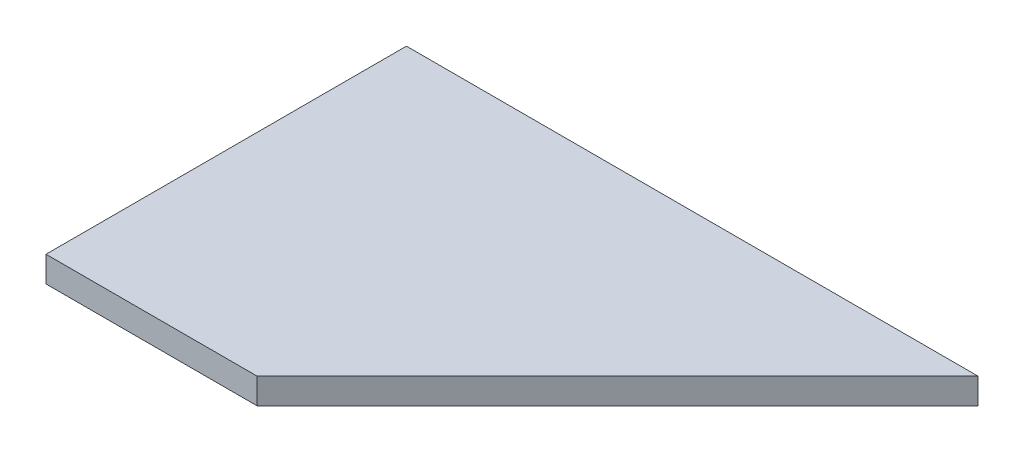
ISO-10303-21;
HEADER;
FILE_DESCRIPTION(('STEP AP214'),'2;1');
FILE_NAME('part.step','',(''),(''),'','','');
FILE_SCHEMA(('AUTOMOTIVE_DESIGN { 1 0 10303 214 1 1 1 1 }'));
ENDSEC;
DATA;
#1=APPLICATION_CONTEXT('core data for automotive mechanical design processes');
#2=APPLICATION_PROTOCOL_DEFINITION('international standard','automotive_design',2000,#1);
#3=PRODUCT_CONTEXT('',#1,'mechanical');
#4=PRODUCT('Part','Part','',(#3));
#5=PRODUCT_RELATED_PRODUCT_CATEGORY('part','',(#4));
#6=PRODUCT_DEFINITION_FORMATION('','',#4);
#7=PRODUCT_DEFINITION_CONTEXT('part definition',#1,'design');
#8=PRODUCT_DEFINITION('design','',#6,#7);
#9=PRODUCT_DEFINITION_SHAPE('','',#8);
#10=(LENGTH_UNIT() NAMED_UNIT(*) SI_UNIT(.MILLI.,.METRE.));
#11=(NAMED_UNIT(*) PLANE_ANGLE_UNIT() SI_UNIT($,.RADIAN.));
#12=(NAMED_UNIT(*) SI_UNIT($,.STERADIAN.) SOLID_ANGLE_UNIT());
#13=UNCERTAINTY_MEASURE_WITH_UNIT(LENGTH_MEASURE(1.E-05),#10,'distance_accuracy_value','');
#14=(GEOMETRIC_REPRESENTATION_CONTEXT(3) GLOBAL_UNCERTAINTY_ASSIGNED_CONTEXT((#13)) GLOBAL_UNIT_ASSIGNED_CONTEXT((#10,
#11,#12)) REPRESENTATION_CONTEXT('',''));
#15=CARTESIAN_POINT('',(0.,0.,0.));
#16=DIRECTION('',(0.,0.,1.));
#17=DIRECTION('',(1.,0.,0.));
#18=AXIS2_PLACEMENT_3D('',#15,#16,#17);
#19=CARTESIAN_POINT('',(-33.3,3.,-21.));
#20=DIRECTION('',(1.,0.,0.));
#21=DIRECTION('',(0.,0.,-1.));
#22=AXIS2_PLACEMENT_3D('',#19,#20,#21);
#23=PLANE('',#22);
#24=DIRECTION('',(0.,0.,1.));
#25=VECTOR('',#24,1.);
#26=CARTESIAN_POINT('',(-33.3,0.,-21.));
#27=LINE('',#26,#25);
#28=CARTESIAN_POINT('',(-33.3,0.,-21.));
#29=VERTEX_POINT('',#28);
#30=CARTESIAN_POINT('',(-33.3,0.,21.));
#31=VERTEX_POINT('',#30);
#32=EDGE_CURVE('E96',#29,#31,#27,.T.);
#33=ORIENTED_EDGE('',*,*,#32,.T.);
#34=DIRECTION('',(0.,-1.,0.));
#35=VECTOR('',#34,1.);
#36=CARTESIAN_POINT('',(-33.3,3.,21.));
#37=LINE('',#36,#35);
#38=CARTESIAN_POINT('',(-33.3,3.,21.));
#39=VERTEX_POINT('',#38);
#40=EDGE_CURVE('E11',#39,#31,#37,.T.);
#41=ORIENTED_EDGE('',*,*,#40,.F.);
#42=DIRECTION('',(0.,0.,1.));
#43=VECTOR('',#42,1.);
#44=CARTESIAN_POINT('',(-33.3,3.,-21.));
#45=LINE('',#44,#43);
#46=CARTESIAN_POINT('',(-33.3,3.,-21.));
#47=VERTEX_POINT('',#46);
#48=EDGE_CURVE('E84',#47,#39,#45,.T.);
#49=ORIENTED_EDGE('',*,*,#48,.F.);
#50=DIRECTION('',(0.,-1.,0.));
#51=VECTOR('',#50,1.);
#52=CARTESIAN_POINT('',(-33.3,3.,-21.));
#53=LINE('',#52,#51);
#54=EDGE_CURVE('E92',#47,#29,#53,.T.);
#55=ORIENTED_EDGE('',*,*,#54,.T.);
#56=EDGE_LOOP('',(#33,#41,#49,#55));
#57=FACE_BOUND('',#56,.T.);
#58=ADVANCED_FACE('F33',(#57),#23,.F.);
#59=CARTESIAN_POINT('',(-33.3,3.,21.));
#60=DIRECTION('',(0.,0.,-1.));
#61=DIRECTION('',(-1.,0.,0.));
#62=AXIS2_PLACEMENT_3D('',#59,#60,#61);
#63=PLANE('',#62);
#64=DIRECTION('',(1.,0.,0.));
#65=VECTOR('',#64,1.);
#66=CARTESIAN_POINT('',(-33.3,0.,21.));
#67=LINE('',#66,#65);
#68=CARTESIAN_POINT('',(-8.69999999999928,0.,21.));
#69=VERTEX_POINT('',#68);
#70=EDGE_CURVE('E88',#31,#69,#67,.T.);
#71=ORIENTED_EDGE('',*,*,#70,.T.);
#72=DIRECTION('',(0.,-1.,0.));
#73=VECTOR('',#72,1.);
#74=CARTESIAN_POINT('',(-8.69999999999928,3.,21.));
#75=LINE('',#74,#73);
#76=CARTESIAN_POINT('',(-8.69999999999928,3.,21.));
#77=VERTEX_POINT('',#76);
#78=EDGE_CURVE('E41',#77,#69,#75,.T.);
#79=ORIENTED_EDGE('',*,*,#78,.F.);
#80=DIRECTION('',(1.,0.,0.));
#81=VECTOR('',#80,1.);
#82=CARTESIAN_POINT('',(-33.3,3.,21.));
#83=LINE('',#82,#81);
#84=EDGE_CURVE('E79',#39,#77,#83,.T.);
#85=ORIENTED_EDGE('',*,*,#84,.F.);
#86=ORIENTED_EDGE('',*,*,#40,.T.);
#87=EDGE_LOOP('',(#71,#79,#85,#86));
#88=FACE_BOUND('',#87,.T.);
#89=ADVANCED_FACE('F87',(#88),#63,.F.);
#90=CARTESIAN_POINT('',(33.3,3.,-21.));
#91=DIRECTION('',(-0.707106781186554,0.,-0.707106781186541));
#92=DIRECTION('',(-0.707106781186541,0.,0.707106781186554));
#93=AXIS2_PLACEMENT_3D('',#90,#91,#92);
#94=PLANE('',#93);
#95=DIRECTION('',(0.707106781186541,0.,-0.707106781186554));
#96=VECTOR('',#95,1.);
#97=CARTESIAN_POINT('',(33.3,0.,-21.));
#98=LINE('',#97,#96);
#99=CARTESIAN_POINT('',(33.3,0.,-21.));
#100=VERTEX_POINT('',#99);
#101=EDGE_CURVE('E66',#69,#100,#98,.T.);
#102=ORIENTED_EDGE('',*,*,#101,.T.);
#103=DIRECTION('',(0.,-1.,0.));
#104=VECTOR('',#103,1.);
#105=CARTESIAN_POINT('',(33.3,3.,-21.));
#106=LINE('',#105,#104);
#107=CARTESIAN_POINT('',(33.3,3.,-21.));
#108=VERTEX_POINT('',#107);
#109=EDGE_CURVE('E89',#108,#100,#106,.T.);
#110=ORIENTED_EDGE('',*,*,#109,.F.);
#111=DIRECTION('',(0.707106781186541,0.,-0.707106781186554));
#112=VECTOR('',#111,1.);
#113=CARTESIAN_POINT('',(33.3,3.,-21.));
#114=LINE('',#113,#112);
#115=EDGE_CURVE('E82',#77,#108,#114,.T.);
#116=ORIENTED_EDGE('',*,*,#115,.F.);
#117=ORIENTED_EDGE('',*,*,#78,.T.);
#118=EDGE_LOOP('',(#102,#110,#116,#117));
#119=FACE_BOUND('',#118,.T.);
#120=ADVANCED_FACE('F90',(#119),#94,.F.);
#121=CARTESIAN_POINT('',(-33.3,3.,-21.));
#122=DIRECTION('',(0.,0.,1.));
#123=DIRECTION('',(1.,0.,0.));
#124=AXIS2_PLACEMENT_3D('',#121,#122,#123);
#125=PLANE('',#124);
#126=DIRECTION('',(-1.,0.,0.));
#127=VECTOR('',#126,1.);
#128=CARTESIAN_POINT('',(-33.3,0.,-21.));
#129=LINE('',#128,#127);
#130=EDGE_CURVE('E72',#100,#29,#129,.T.);
#131=ORIENTED_EDGE('',*,*,#130,.T.);
#132=ORIENTED_EDGE('',*,*,#54,.F.);
#133=DIRECTION('',(-1.,0.,0.));
#134=VECTOR('',#133,1.);
#135=CARTESIAN_POINT('',(-33.3,3.,-21.));
#136=LINE('',#135,#134);
#137=EDGE_CURVE('E49',#108,#47,#136,.T.);
#138=ORIENTED_EDGE('',*,*,#137,.F.);
#139=ORIENTED_EDGE('',*,*,#109,.T.);
#140=EDGE_LOOP('',(#131,#132,#138,#139));
#141=FACE_BOUND('',#140,.T.);
#142=ADVANCED_FACE('F103',(#141),#125,.F.);
#143=CARTESIAN_POINT('',(0.,3.,0.));
#144=DIRECTION('',(0.,1.,0.));
#145=DIRECTION('',(0.,0.,1.));
#146=AXIS2_PLACEMENT_3D('',#143,#144,#145);
#147=PLANE('',#146);
#148=ORIENTED_EDGE('',*,*,#48,.T.);
#149=ORIENTED_EDGE('',*,*,#84,.T.);
#150=ORIENTED_EDGE('',*,*,#115,.T.);
#151=ORIENTED_EDGE('',*,*,#137,.T.);
#152=EDGE_LOOP('',(#148,#149,#150,#151));
#153=FACE_BOUND('',#152,.T.);
#154=ADVANCED_FACE('F80',(#153),#147,.T.);
#155=CARTESIAN_POINT('',(0.,0.,0.));
#156=DIRECTION('',(0.,1.,0.));
#157=DIRECTION('',(0.,0.,1.));
#158=AXIS2_PLACEMENT_3D('',#155,#156,#157);
#159=PLANE('',#158);
#160=ORIENTED_EDGE('',*,*,#32,.F.);
#161=ORIENTED_EDGE('',*,*,#130,.F.);
#162=ORIENTED_EDGE('',*,*,#101,.F.);
#163=ORIENTED_EDGE('',*,*,#70,.F.);
#164=EDGE_LOOP('',(#160,#161,#162,#163));
#165=FACE_BOUND('',#164,.T.);
#166=ADVANCED_FACE('F106',(#165),#159,.F.);
#167=CLOSED_SHELL('',(#58,#89,#120,#142,#154,#166));
#168=MANIFOLD_SOLID_BREP('B2',#167);
#169=ADVANCED_BREP_SHAPE_REPRESENTATION('',(#18,#168),#14);
#170=SHAPE_DEFINITION_REPRESENTATION(#9,#169);
ENDSEC;
END-ISO-10303-21;
